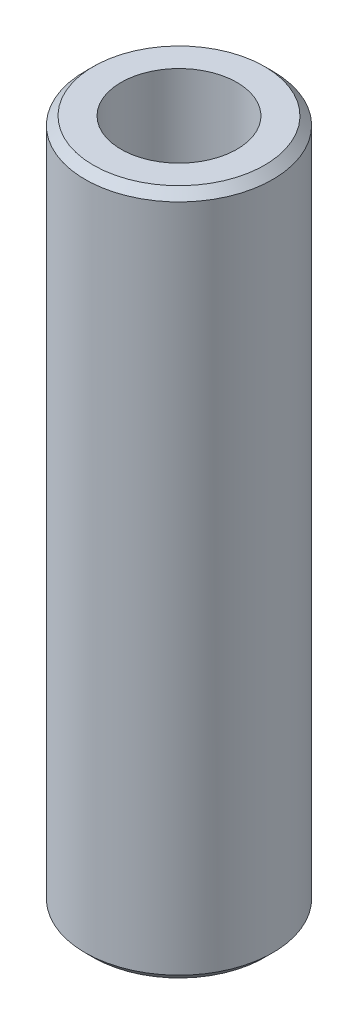
ISO-10303-21;
HEADER;
FILE_DESCRIPTION(('STEP AP214'),'2;1');
FILE_NAME('part.step','',(''),(''),'','','');
FILE_SCHEMA(('AUTOMOTIVE_DESIGN { 1 0 10303 214 1 1 1 1 }'));
ENDSEC;
DATA;
#1=APPLICATION_CONTEXT('core data for automotive mechanical design processes');
#2=APPLICATION_PROTOCOL_DEFINITION('international standard','automotive_design',2000,#1);
#3=PRODUCT_CONTEXT('',#1,'mechanical');
#4=PRODUCT('Part','Part','',(#3));
#5=PRODUCT_RELATED_PRODUCT_CATEGORY('part','',(#4));
#6=PRODUCT_DEFINITION_FORMATION('','',#4);
#7=PRODUCT_DEFINITION_CONTEXT('part definition',#1,'design');
#8=PRODUCT_DEFINITION('design','',#6,#7);
#9=PRODUCT_DEFINITION_SHAPE('','',#8);
#10=(LENGTH_UNIT() NAMED_UNIT(*) SI_UNIT(.MILLI.,.METRE.));
#11=(NAMED_UNIT(*) PLANE_ANGLE_UNIT() SI_UNIT($,.RADIAN.));
#12=(NAMED_UNIT(*) SI_UNIT($,.STERADIAN.) SOLID_ANGLE_UNIT());
#13=UNCERTAINTY_MEASURE_WITH_UNIT(LENGTH_MEASURE(1.E-05),#10,'distance_accuracy_value','');
#14=(GEOMETRIC_REPRESENTATION_CONTEXT(3) GLOBAL_UNCERTAINTY_ASSIGNED_CONTEXT((#13)) GLOBAL_UNIT_ASSIGNED_CONTEXT((#10,
#11,#12)) REPRESENTATION_CONTEXT('',''));
#15=CARTESIAN_POINT('',(0.,0.,0.));
#16=DIRECTION('',(0.,0.,1.));
#17=DIRECTION('',(1.,0.,0.));
#18=AXIS2_PLACEMENT_3D('',#15,#16,#17);
#19=CARTESIAN_POINT('',(0.,347.431284477158,0.));
#20=DIRECTION('',(0.,-1.,0.));
#21=DIRECTION('',(0.,0.,-1.));
#22=AXIS2_PLACEMENT_3D('',#19,#20,#21);
#23=CYLINDRICAL_SURFACE('',#22,47.5);
#24=CARTESIAN_POINT('',(0.,343.260226425352,0.));
#25=DIRECTION('',(0.,1.,0.));
#26=DIRECTION('',(0.,0.,1.));
#27=AXIS2_PLACEMENT_3D('',#24,#25,#26);
#28=CIRCLE('',#27,47.5);
#29=CARTESIAN_POINT('',(0.,343.260226425352,-47.5));
#30=VERTEX_POINT('',#29);
#31=EDGE_CURVE('E50',#30,#30,#28,.F.);
#32=CARTESIAN_POINT('',(0.,4.17105805180667,0.));
#33=DIRECTION('',(0.,1.,0.));
#34=DIRECTION('',(0.,0.,1.));
#35=AXIS2_PLACEMENT_3D('',#32,#33,#34);
#36=CIRCLE('',#35,47.5);
#37=CARTESIAN_POINT('',(0.,4.17105805180662,-47.5));
#38=VERTEX_POINT('',#37);
#39=EDGE_CURVE('E51',#38,#38,#36,.T.);
#40=CARTESIAN_POINT('',(0.,343.260226425352,-47.5));
#41=CARTESIAN_POINT('',(0.,339.728047588127,-47.5));
#42=CARTESIAN_POINT('',(0.,336.195868750903,-47.5));
#43=CARTESIAN_POINT('',(0.,329.131511076454,-47.5));
#44=CARTESIAN_POINT('',(0.,325.599332239229,-47.5));
#45=CARTESIAN_POINT('',(0.,318.534974564781,-47.5));
#46=CARTESIAN_POINT('',(0.,315.002795727556,-47.5));
#47=CARTESIAN_POINT('',(0.,307.938438053107,-47.5));
#48=CARTESIAN_POINT('',(0.,304.406259215883,-47.5));
#49=CARTESIAN_POINT('',(0.,297.341901541434,-47.5));
#50=CARTESIAN_POINT('',(0.,293.80972270421,-47.5));
#51=CARTESIAN_POINT('',(0.,286.745365029761,-47.5));
#52=CARTESIAN_POINT('',(0.,283.213186192536,-47.5));
#53=CARTESIAN_POINT('',(0.,276.148828518087,-47.5));
#54=CARTESIAN_POINT('',(0.,272.616649680863,-47.5));
#55=CARTESIAN_POINT('',(0.,265.552292006414,-47.5));
#56=CARTESIAN_POINT('',(0.,262.02011316919,-47.5));
#57=CARTESIAN_POINT('',(0.,254.955755494741,-47.5));
#58=CARTESIAN_POINT('',(0.,251.423576657516,-47.5));
#59=CARTESIAN_POINT('',(0.,244.359218983068,-47.5));
#60=CARTESIAN_POINT('',(0.,240.827040145843,-47.5));
#61=CARTESIAN_POINT('',(0.,233.762682471394,-47.5));
#62=CARTESIAN_POINT('',(0.,230.23050363417,-47.5));
#63=CARTESIAN_POINT('',(0.,223.166145959721,-47.5));
#64=CARTESIAN_POINT('',(0.,219.633967122497,-47.5));
#65=CARTESIAN_POINT('',(0.,212.569609448048,-47.5));
#66=CARTESIAN_POINT('',(0.,209.037430610823,-47.5));
#67=CARTESIAN_POINT('',(0.,201.973072936375,-47.5));
#68=CARTESIAN_POINT('',(0.,198.44089409915,-47.5));
#69=CARTESIAN_POINT('',(0.,191.376536424701,-47.5));
#70=CARTESIAN_POINT('',(0.,187.844357587477,-47.5));
#71=CARTESIAN_POINT('',(0.,180.779999913028,-47.5));
#72=CARTESIAN_POINT('',(0.,177.247821075804,-47.5));
#73=CARTESIAN_POINT('',(0.,170.183463401355,-47.5));
#74=CARTESIAN_POINT('',(0.,166.65128456413,-47.5));
#75=CARTESIAN_POINT('',(0.,159.586926889681,-47.5));
#76=CARTESIAN_POINT('',(0.,156.054748052457,-47.5));
#77=CARTESIAN_POINT('',(0.,148.990390378008,-47.5));
#78=CARTESIAN_POINT('',(0.,145.458211540784,-47.5));
#79=CARTESIAN_POINT('',(0.,138.393853866335,-47.5));
#80=CARTESIAN_POINT('',(0.,134.86167502911,-47.5));
#81=CARTESIAN_POINT('',(0.,127.797317354662,-47.5));
#82=CARTESIAN_POINT('',(0.,124.265138517437,-47.5));
#83=CARTESIAN_POINT('',(0.,117.200780842988,-47.5));
#84=CARTESIAN_POINT('',(0.,113.668602005764,-47.5));
#85=CARTESIAN_POINT('',(0.,106.604244331315,-47.5));
#86=CARTESIAN_POINT('',(0.,103.072065494091,-47.5));
#87=CARTESIAN_POINT('',(0.,96.0077078196417,-47.5));
#88=CARTESIAN_POINT('',(0.,92.4755289824173,-47.5));
#89=CARTESIAN_POINT('',(0.,85.4111713079684,-47.5));
#90=CARTESIAN_POINT('',(0.,81.878992470744,-47.5));
#91=CARTESIAN_POINT('',(0.,74.8146347962952,-47.5));
#92=CARTESIAN_POINT('',(0.,71.2824559590707,-47.5));
#93=CARTESIAN_POINT('',(0.,64.2180982846219,-47.5));
#94=CARTESIAN_POINT('',(0.,60.6859194473975,-47.5));
#95=CARTESIAN_POINT('',(0.,53.6215617729486,-47.5));
#96=CARTESIAN_POINT('',(0.,50.0893829357242,-47.5));
#97=CARTESIAN_POINT('',(0.,43.0250252612753,-47.5));
#98=CARTESIAN_POINT('',(0.,39.4928464240509,-47.5));
#99=CARTESIAN_POINT('',(0.,32.428488749602,-47.5));
#100=CARTESIAN_POINT('',(0.,28.8963099123776,-47.5));
#101=CARTESIAN_POINT('',(0.,21.8319522379288,-47.5));
#102=CARTESIAN_POINT('',(0.,18.2997734007043,-47.5));
#103=CARTESIAN_POINT('',(0.,11.2354157262555,-47.5));
#104=CARTESIAN_POINT('',(0.,7.70323688903105,-47.5));
#105=CARTESIAN_POINT('',(0.,4.17105805180662,-47.5));
#106=B_SPLINE_CURVE_WITH_KNOTS('',3,(#40,#41,#42,#43,#44,#45,#46,#47,#48,#49,#50,#51,#52,#53,
#54,#55,#56,#57,#58,#59,#60,#61,#62,#63,#64,#65,#66,#67,#68,#69,#70,#71,#72,#73,#74,#75,#76,#77,
#78,#79,#80,#81,#82,#83,#84,#85,#86,#87,#88,#89,#90,#91,#92,#93,#94,#95,#96,#97,#98,#99,#100,
#101,#102,#103,#104,#105),.UNSPECIFIED.,.F.,.F.,(4,2,2,2,2,2,2,2,2,2,2,2,2,2,2,2,2,2,2,2,2,2,2,
2,2,2,2,2,2,2,2,2,4),(0.,10.5965365116732,21.1930730233466,31.7896095350198,42.3861460466931,
52.9826825583664,63.5792190700397,74.1757555817129,84.7722920933862,95.3688286050595,
105.965365116733,116.561901628406,127.158438140079,137.754974651753,148.351511163426,
158.948047675099,169.544584186772,180.141120698446,190.737657210119,201.334193721792,
211.930730233466,222.527266745139,233.123803256812,243.720339768485,254.316876280159,
264.913412791832,275.509949303505,286.106485815179,296.703022326852,307.299558838525,
317.896095350198,328.492631861872,339.089168373545),.UNSPECIFIED.);
#107=EDGE_CURVE('BSEAM39',#30,#38,#106,.T.);
#108=ORIENTED_EDGE('',*,*,#31,.T.);
#109=ORIENTED_EDGE('',*,*,#39,.T.);
#110=ORIENTED_EDGE('',*,*,#107,.T.);
#111=ORIENTED_EDGE('',*,*,#107,.F.);
#112=EDGE_LOOP('',(#108,#110,#109,#111));
#113=FACE_BOUND('',#112,.T.);
#114=ADVANCED_FACE('F39',(#113),#23,.T.);
#115=CARTESIAN_POINT('',(0.,347.431284477158,0.));
#116=DIRECTION('',(0.,1.,0.));
#117=DIRECTION('',(0.,0.,1.));
#118=AXIS2_PLACEMENT_3D('',#115,#116,#117);
#119=PLANE('',#118);
#120=CARTESIAN_POINT('',(0.,347.431284477158,0.));
#121=DIRECTION('',(0.,1.,0.));
#122=DIRECTION('',(0.,0.,1.));
#123=AXIS2_PLACEMENT_3D('',#120,#121,#122);
#124=CIRCLE('',#123,43.3289419481938);
#125=CARTESIAN_POINT('',(0.,347.431284477158,43.3289419481938));
#126=VERTEX_POINT('',#125);
#127=EDGE_CURVE('E54',#126,#126,#124,.T.);
#128=ORIENTED_EDGE('',*,*,#127,.T.);
#129=EDGE_LOOP('',(#128));
#130=FACE_BOUND('',#129,.T.);
#131=CARTESIAN_POINT('',(0.,347.431284477158,0.));
#132=DIRECTION('',(0.,1.,0.));
#133=DIRECTION('',(0.,0.,1.));
#134=AXIS2_PLACEMENT_3D('',#131,#132,#133);
#135=CIRCLE('',#134,29.3537617347335);
#136=CARTESIAN_POINT('',(0.,347.431284477158,-29.3537617347335));
#137=VERTEX_POINT('',#136);
#138=EDGE_CURVE('E58',#137,#137,#135,.T.);
#139=ORIENTED_EDGE('',*,*,#138,.F.);
#140=EDGE_LOOP('',(#139));
#141=FACE_BOUND('',#140,.T.);
#142=ADVANCED_FACE('F69',(#130,#141),#119,.T.);
#143=CARTESIAN_POINT('',(0.,0.,0.));
#144=DIRECTION('',(0.,1.,0.));
#145=DIRECTION('',(0.,0.,1.));
#146=AXIS2_PLACEMENT_3D('',#143,#144,#145);
#147=PLANE('',#146);
#148=CARTESIAN_POINT('',(0.,0.,0.));
#149=DIRECTION('',(0.,1.,0.));
#150=DIRECTION('',(0.,0.,1.));
#151=AXIS2_PLACEMENT_3D('',#148,#149,#150);
#152=CIRCLE('',#151,43.3289419481933);
#153=CARTESIAN_POINT('',(0.,0.,43.3289419481933));
#154=VERTEX_POINT('',#153);
#155=EDGE_CURVE('E10',#154,#154,#152,.F.);
#156=ORIENTED_EDGE('',*,*,#155,.T.);
#157=EDGE_LOOP('',(#156));
#158=FACE_BOUND('',#157,.T.);
#159=CARTESIAN_POINT('',(0.,0.,0.));
#160=DIRECTION('',(0.,1.,0.));
#161=DIRECTION('',(0.,0.,1.));
#162=AXIS2_PLACEMENT_3D('',#159,#160,#161);
#163=CIRCLE('',#162,29.3537617347335);
#164=CARTESIAN_POINT('',(0.,0.,-29.3537617347335));
#165=VERTEX_POINT('',#164);
#166=EDGE_CURVE('E63',#165,#165,#163,.T.);
#167=ORIENTED_EDGE('',*,*,#166,.T.);
#168=EDGE_LOOP('',(#167));
#169=FACE_BOUND('',#168,.T.);
#170=ADVANCED_FACE('F75',(#158,#169),#147,.F.);
#171=CARTESIAN_POINT('',(0.,347.431284477158,0.));
#172=DIRECTION('',(0.,-1.,0.));
#173=DIRECTION('',(0.,0.,-1.));
#174=AXIS2_PLACEMENT_3D('',#171,#172,#173);
#175=CYLINDRICAL_SURFACE('',#174,29.3537617347335);
#176=CARTESIAN_POINT('',(0.,347.431284477158,-29.3537617347335));
#177=CARTESIAN_POINT('',(0.,343.812208597187,-29.3537617347335));
#178=CARTESIAN_POINT('',(0.,340.193132717217,-29.3537617347335));
#179=CARTESIAN_POINT('',(0.,332.954980957276,-29.3537617347335));
#180=CARTESIAN_POINT('',(0.,329.335905077306,-29.3537617347335));
#181=CARTESIAN_POINT('',(0.,322.097753317365,-29.3537617347335));
#182=CARTESIAN_POINT('',(0.,318.478677437395,-29.3537617347335));
#183=CARTESIAN_POINT('',(0.,311.240525677454,-29.3537617347335));
#184=CARTESIAN_POINT('',(0.,307.621449797483,-29.3537617347335));
#185=CARTESIAN_POINT('',(0.,300.383298037543,-29.3537617347335));
#186=CARTESIAN_POINT('',(0.,296.764222157572,-29.3537617347335));
#187=CARTESIAN_POINT('',(0.,289.526070397631,-29.3537617347335));
#188=CARTESIAN_POINT('',(0.,285.906994517661,-29.3537617347335));
#189=CARTESIAN_POINT('',(0.,278.66884275772,-29.3537617347335));
#190=CARTESIAN_POINT('',(0.,275.04976687775,-29.3537617347335));
#191=CARTESIAN_POINT('',(0.,267.811615117809,-29.3537617347335));
#192=CARTESIAN_POINT('',(0.,264.192539237839,-29.3537617347335));
#193=CARTESIAN_POINT('',(0.,256.954387477898,-29.3537617347335));
#194=CARTESIAN_POINT('',(0.,253.335311597928,-29.3537617347335));
#195=CARTESIAN_POINT('',(0.,246.097159837987,-29.3537617347335));
#196=CARTESIAN_POINT('',(0.,242.478083958016,-29.3537617347335));
#197=CARTESIAN_POINT('',(0.,235.239932198076,-29.3537617347335));
#198=CARTESIAN_POINT('',(0.,231.620856318105,-29.3537617347335));
#199=CARTESIAN_POINT('',(0.,224.382704558164,-29.3537617347335));
#200=CARTESIAN_POINT('',(0.,220.763628678194,-29.3537617347335));
#201=CARTESIAN_POINT('',(0.,213.525476918253,-29.3537617347335));
#202=CARTESIAN_POINT('',(0.,209.906401038283,-29.3537617347335));
#203=CARTESIAN_POINT('',(0.,202.668249278342,-29.3537617347335));
#204=CARTESIAN_POINT('',(0.,199.049173398372,-29.3537617347335));
#205=CARTESIAN_POINT('',(0.,191.811021638431,-29.3537617347335));
#206=CARTESIAN_POINT('',(0.,188.19194575846,-29.3537617347335));
#207=CARTESIAN_POINT('',(0.,180.95379399852,-29.3537617347335));
#208=CARTESIAN_POINT('',(0.,177.334718118549,-29.3537617347335));
#209=CARTESIAN_POINT('',(0.,170.096566358608,-29.3537617347335));
#210=CARTESIAN_POINT('',(0.,166.477490478638,-29.3537617347335));
#211=CARTESIAN_POINT('',(0.,159.239338718697,-29.3537617347335));
#212=CARTESIAN_POINT('',(0.,155.620262838727,-29.3537617347335));
#213=CARTESIAN_POINT('',(0.,148.382111078786,-29.3537617347335));
#214=CARTESIAN_POINT('',(0.,144.763035198816,-29.3537617347335));
#215=CARTESIAN_POINT('',(0.,137.524883438875,-29.3537617347335));
#216=CARTESIAN_POINT('',(0.,133.905807558905,-29.3537617347335));
#217=CARTESIAN_POINT('',(0.,126.667655798964,-29.3537617347335));
#218=CARTESIAN_POINT('',(0.,123.048579918993,-29.3537617347335));
#219=CARTESIAN_POINT('',(0.,115.810428159053,-29.3537617347335));
#220=CARTESIAN_POINT('',(0.,112.191352279082,-29.3537617347335));
#221=CARTESIAN_POINT('',(0.,104.953200519141,-29.3537617347335));
#222=CARTESIAN_POINT('',(0.,101.334124639171,-29.3537617347335));
#223=CARTESIAN_POINT('',(0.,94.0959728792302,-29.3537617347335));
#224=CARTESIAN_POINT('',(0.,90.4768969992598,-29.3537617347335));
#225=CARTESIAN_POINT('',(0.,83.2387452393191,-29.3537617347335));
#226=CARTESIAN_POINT('',(0.,79.6196693593487,-29.3537617347335));
#227=CARTESIAN_POINT('',(0.,72.3815175994079,-29.3537617347335));
#228=CARTESIAN_POINT('',(0.,68.7624417194375,-29.3537617347335));
#229=CARTESIAN_POINT('',(0.,61.5242899594967,-29.3537617347335));
#230=CARTESIAN_POINT('',(0.,57.9052140795263,-29.3537617347335));
#231=CARTESIAN_POINT('',(0.,50.6670623195855,-29.3537617347335));
#232=CARTESIAN_POINT('',(0.,47.0479864396151,-29.3537617347335));
#233=CARTESIAN_POINT('',(0.,39.8098346796743,-29.3537617347335));
#234=CARTESIAN_POINT('',(0.,36.1907587997039,-29.3537617347335));
#235=CARTESIAN_POINT('',(0.,28.9526070397632,-29.3537617347335));
#236=CARTESIAN_POINT('',(0.,25.3335311597928,-29.3537617347335));
#237=CARTESIAN_POINT('',(0.,18.095379399852,-29.3537617347335));
#238=CARTESIAN_POINT('',(0.,14.4763035198816,-29.3537617347335));
#239=CARTESIAN_POINT('',(0.,7.2381517599408,-29.3537617347335));
#240=CARTESIAN_POINT('',(0.,3.6190758799704,-29.3537617347335));
#241=CARTESIAN_POINT('',(0.,0.,-29.3537617347335));
#242=B_SPLINE_CURVE_WITH_KNOTS('',3,(#176,#177,#178,#179,#180,#181,#182,#183,#184,#185,#186,
#187,#188,#189,#190,#191,#192,#193,#194,#195,#196,#197,#198,#199,#200,#201,#202,#203,#204,#205,
#206,#207,#208,#209,#210,#211,#212,#213,#214,#215,#216,#217,#218,#219,#220,#221,#222,#223,#224,
#225,#226,#227,#228,#229,#230,#231,#232,#233,#234,#235,#236,#237,#238,#239,#240,#241),
.UNSPECIFIED.,.F.,.F.,(4,2,2,2,2,2,2,2,2,2,2,2,2,2,2,2,2,2,2,2,2,2,2,2,2,2,2,2,2,2,2,2,4),(0.,
10.8572276399112,21.7144552798224,32.5716829197336,43.4289105596448,54.2861381995559,
65.1433658394671,76.0005934793783,86.8578211192895,97.7150487592007,108.572276399112,
119.429504039023,130.286731678934,141.143959318845,152.001186958757,162.858414598668,
173.715642238579,184.57286987849,195.430097518401,206.287325158312,217.144552798224,
228.001780438135,238.859008078046,249.716235717957,260.573463357868,271.43069099778,
282.287918637691,293.145146277602,304.002373917513,314.859601557424,325.716829197335,
336.574056837247,347.431284477158),.UNSPECIFIED.);
#243=EDGE_CURVE('BSEAM70',#137,#165,#242,.T.);
#244=ORIENTED_EDGE('',*,*,#138,.T.);
#245=ORIENTED_EDGE('',*,*,#166,.F.);
#246=ORIENTED_EDGE('',*,*,#243,.T.);
#247=ORIENTED_EDGE('',*,*,#243,.F.);
#248=EDGE_LOOP('',(#244,#246,#245,#247));
#249=FACE_BOUND('',#248,.T.);
#250=ADVANCED_FACE('F70',(#249),#175,.F.);
#251=CARTESIAN_POINT('',(0.,347.431284477158,0.));
#252=DIRECTION('',(0.,-1.,0.));
#253=DIRECTION('',(0.,0.,-1.));
#254=AXIS2_PLACEMENT_3D('',#251,#252,#253);
#255=CONICAL_SURFACE('',#254,43.3289419481938,0.785398163397445);
#256=ORIENTED_EDGE('',*,*,#31,.F.);
#257=EDGE_LOOP('',(#256));
#258=FACE_BOUND('',#257,.T.);
#259=ORIENTED_EDGE('',*,*,#127,.F.);
#260=EDGE_LOOP('',(#259));
#261=FACE_BOUND('',#260,.T.);
#262=ADVANCED_FACE('F81',(#258,#261),#255,.T.);
#263=CARTESIAN_POINT('',(0.,4.17105805180667,0.));
#264=DIRECTION('',(0.,1.,0.));
#265=DIRECTION('',(0.,0.,1.));
#266=AXIS2_PLACEMENT_3D('',#263,#264,#265);
#267=CONICAL_SURFACE('',#266,47.5,0.785398163397452);
#268=ORIENTED_EDGE('',*,*,#155,.F.);
#269=EDGE_LOOP('',(#268));
#270=FACE_BOUND('',#269,.T.);
#271=ORIENTED_EDGE('',*,*,#39,.F.);
#272=EDGE_LOOP('',(#271));
#273=FACE_BOUND('',#272,.T.);
#274=ADVANCED_FACE('F45',(#270,#273),#267,.T.);
#275=CLOSED_SHELL('',(#114,#142,#170,#250,#262,#274));
#276=MANIFOLD_SOLID_BREP('B2',#275);
#277=ADVANCED_BREP_SHAPE_REPRESENTATION('',(#18,#276),#14);
#278=SHAPE_DEFINITION_REPRESENTATION(#9,#277);
ENDSEC;
END-ISO-10303-21;
